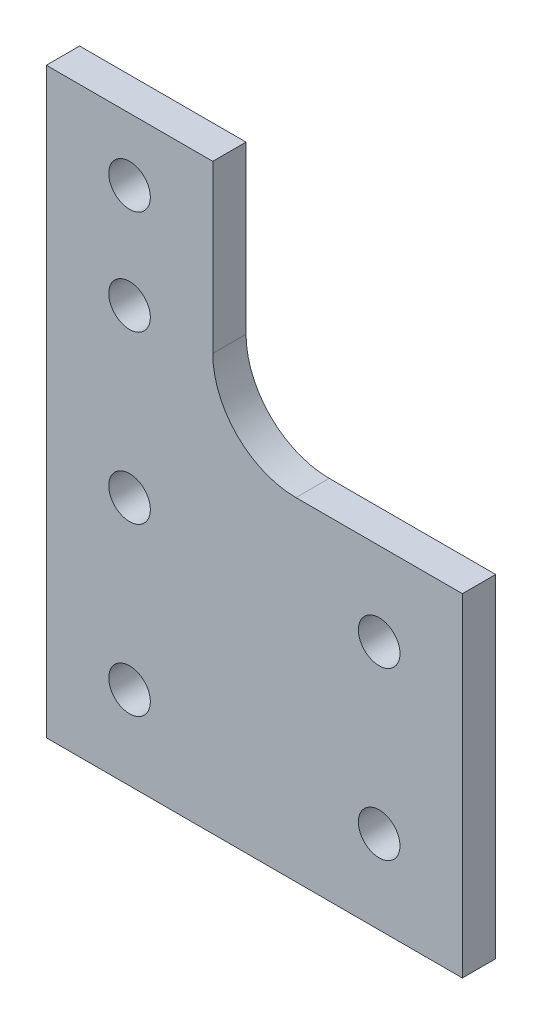
ISO-10303-21;
HEADER;
FILE_DESCRIPTION(('STEP AP214'),'2;1');
FILE_NAME('part.step','',(''),(''),'','','');
FILE_SCHEMA(('AUTOMOTIVE_DESIGN { 1 0 10303 214 1 1 1 1 }'));
ENDSEC;
DATA;
#1=APPLICATION_CONTEXT('core data for automotive mechanical design processes');
#2=APPLICATION_PROTOCOL_DEFINITION('international standard','automotive_design',2000,#1);
#3=PRODUCT_CONTEXT('',#1,'mechanical');
#4=PRODUCT('Part','Part','',(#3));
#5=PRODUCT_RELATED_PRODUCT_CATEGORY('part','',(#4));
#6=PRODUCT_DEFINITION_FORMATION('','',#4);
#7=PRODUCT_DEFINITION_CONTEXT('part definition',#1,'design');
#8=PRODUCT_DEFINITION('design','',#6,#7);
#9=PRODUCT_DEFINITION_SHAPE('','',#8);
#10=(LENGTH_UNIT() NAMED_UNIT(*) SI_UNIT(.MILLI.,.METRE.));
#11=(NAMED_UNIT(*) PLANE_ANGLE_UNIT() SI_UNIT($,.RADIAN.));
#12=(NAMED_UNIT(*) SI_UNIT($,.STERADIAN.) SOLID_ANGLE_UNIT());
#13=UNCERTAINTY_MEASURE_WITH_UNIT(LENGTH_MEASURE(1.E-05),#10,'distance_accuracy_value','');
#14=(GEOMETRIC_REPRESENTATION_CONTEXT(3) GLOBAL_UNCERTAINTY_ASSIGNED_CONTEXT((#13)) GLOBAL_UNIT_ASSIGNED_CONTEXT((#10,
#11,#12)) REPRESENTATION_CONTEXT('',''));
#15=CARTESIAN_POINT('',(0.,0.,0.));
#16=DIRECTION('',(0.,0.,1.));
#17=DIRECTION('',(1.,0.,0.));
#18=AXIS2_PLACEMENT_3D('',#15,#16,#17);
#19=CARTESIAN_POINT('',(9.99999999999999,20.,4.));
#20=DIRECTION('',(0.,0.,-1.));
#21=DIRECTION('',(-1.,0.,0.));
#22=AXIS2_PLACEMENT_3D('',#19,#20,#21);
#23=PLANE('',#22);
#24=CARTESIAN_POINT('',(9.99999999999999,20.,4.));
#25=DIRECTION('',(0.,0.,-1.));
#26=DIRECTION('',(-1.,0.,0.));
#27=AXIS2_PLACEMENT_3D('',#24,#25,#26);
#28=CIRCLE('',#27,10.);
#29=CARTESIAN_POINT('',(10.0000000000001,9.99999999999995,4.));
#30=VERTEX_POINT('',#29);
#31=CARTESIAN_POINT('',(0.,20.,4.));
#32=VERTEX_POINT('',#31);
#33=EDGE_CURVE('E138',#30,#32,#28,.T.);
#34=ORIENTED_EDGE('',*,*,#33,.T.);
#35=DIRECTION('',(0.,1.,0.));
#36=VECTOR('',#35,1.);
#37=CARTESIAN_POINT('',(0.,40.,4.));
#38=LINE('',#37,#36);
#39=CARTESIAN_POINT('',(0.,40.,4.));
#40=VERTEX_POINT('',#39);
#41=EDGE_CURVE('E91',#32,#40,#38,.T.);
#42=ORIENTED_EDGE('',*,*,#41,.T.);
#43=DIRECTION('',(-1.,0.,0.));
#44=VECTOR('',#43,1.);
#45=CARTESIAN_POINT('',(-19.9999999999999,40.,4.));
#46=LINE('',#45,#44);
#47=CARTESIAN_POINT('',(-19.9999999999999,40.,4.));
#48=VERTEX_POINT('',#47);
#49=EDGE_CURVE('E150',#40,#48,#46,.T.);
#50=ORIENTED_EDGE('',*,*,#49,.T.);
#51=DIRECTION('',(0.,-1.,0.));
#52=VECTOR('',#51,1.);
#53=CARTESIAN_POINT('',(-19.9999999999999,-30.,4.));
#54=LINE('',#53,#52);
#55=CARTESIAN_POINT('',(-19.9999999999999,-30.,4.));
#56=VERTEX_POINT('',#55);
#57=EDGE_CURVE('E107',#48,#56,#54,.T.);
#58=ORIENTED_EDGE('',*,*,#57,.T.);
#59=DIRECTION('',(1.,0.,0.));
#60=VECTOR('',#59,1.);
#61=CARTESIAN_POINT('',(-19.9999999999999,-30.,4.));
#62=LINE('',#61,#60);
#63=CARTESIAN_POINT('',(30.,-30.,4.));
#64=VERTEX_POINT('',#63);
#65=EDGE_CURVE('E101',#56,#64,#62,.T.);
#66=ORIENTED_EDGE('',*,*,#65,.T.);
#67=DIRECTION('',(0.,1.,0.));
#68=VECTOR('',#67,1.);
#69=CARTESIAN_POINT('',(30.,-30.,4.));
#70=LINE('',#69,#68);
#71=CARTESIAN_POINT('',(30.,9.99999999999995,4.));
#72=VERTEX_POINT('',#71);
#73=EDGE_CURVE('E105',#64,#72,#70,.T.);
#74=ORIENTED_EDGE('',*,*,#73,.T.);
#75=DIRECTION('',(-1.,0.,0.));
#76=VECTOR('',#75,1.);
#77=CARTESIAN_POINT('',(30.,9.99999999999995,4.));
#78=LINE('',#77,#76);
#79=EDGE_CURVE('E51',#72,#30,#78,.T.);
#80=ORIENTED_EDGE('',*,*,#79,.T.);
#81=EDGE_LOOP('',(#34,#42,#50,#58,#66,#74,#80));
#82=FACE_BOUND('',#81,.T.);
#83=CARTESIAN_POINT('',(-9.99999999999949,32.5,4.));
#84=DIRECTION('',(0.,0.,1.));
#85=DIRECTION('',(1.,0.,0.));
#86=AXIS2_PLACEMENT_3D('',#83,#84,#85);
#87=CIRCLE('',#86,2.49999999999992);
#88=CARTESIAN_POINT('',(-7.49999999999957,32.5,4.));
#89=VERTEX_POINT('',#88);
#90=EDGE_CURVE('E129',#89,#89,#87,.T.);
#91=ORIENTED_EDGE('',*,*,#90,.F.);
#92=EDGE_LOOP('',(#91));
#93=FACE_BOUND('',#92,.T.);
#94=CARTESIAN_POINT('',(-9.99999999999997,0.,4.));
#95=DIRECTION('',(0.,0.,1.));
#96=DIRECTION('',(1.,0.,0.));
#97=AXIS2_PLACEMENT_3D('',#94,#95,#96);
#98=CIRCLE('',#97,2.49999999999992);
#99=CARTESIAN_POINT('',(-7.50000000000005,0.,4.));
#100=VERTEX_POINT('',#99);
#101=EDGE_CURVE('E165',#100,#100,#98,.T.);
#102=ORIENTED_EDGE('',*,*,#101,.F.);
#103=EDGE_LOOP('',(#102));
#104=FACE_BOUND('',#103,.T.);
#105=CARTESIAN_POINT('',(-9.99999999999997,-20.,4.));
#106=DIRECTION('',(0.,0.,1.));
#107=DIRECTION('',(1.,0.,0.));
#108=AXIS2_PLACEMENT_3D('',#105,#106,#107);
#109=CIRCLE('',#108,2.49999999999992);
#110=CARTESIAN_POINT('',(-7.50000000000005,-20.,4.));
#111=VERTEX_POINT('',#110);
#112=EDGE_CURVE('E171',#111,#111,#109,.T.);
#113=ORIENTED_EDGE('',*,*,#112,.F.);
#114=EDGE_LOOP('',(#113));
#115=FACE_BOUND('',#114,.T.);
#116=CARTESIAN_POINT('',(20.,0.,4.));
#117=DIRECTION('',(0.,0.,1.));
#118=DIRECTION('',(1.,0.,0.));
#119=AXIS2_PLACEMENT_3D('',#116,#117,#118);
#120=CIRCLE('',#119,2.49999999999992);
#121=CARTESIAN_POINT('',(22.4999999999999,0.,4.));
#122=VERTEX_POINT('',#121);
#123=EDGE_CURVE('E177',#122,#122,#120,.T.);
#124=ORIENTED_EDGE('',*,*,#123,.F.);
#125=EDGE_LOOP('',(#124));
#126=FACE_BOUND('',#125,.T.);
#127=CARTESIAN_POINT('',(20.,-20.,4.));
#128=DIRECTION('',(0.,0.,1.));
#129=DIRECTION('',(1.,0.,0.));
#130=AXIS2_PLACEMENT_3D('',#127,#128,#129);
#131=CIRCLE('',#130,2.49999999999992);
#132=CARTESIAN_POINT('',(22.4999999999999,-20.,4.));
#133=VERTEX_POINT('',#132);
#134=EDGE_CURVE('E183',#133,#133,#131,.T.);
#135=ORIENTED_EDGE('',*,*,#134,.F.);
#136=EDGE_LOOP('',(#135));
#137=FACE_BOUND('',#136,.T.);
#138=CARTESIAN_POINT('',(-9.9999999999996,20.,4.));
#139=DIRECTION('',(0.,0.,1.));
#140=DIRECTION('',(1.,0.,0.));
#141=AXIS2_PLACEMENT_3D('',#138,#139,#140);
#142=CIRCLE('',#141,2.49999999999992);
#143=CARTESIAN_POINT('',(-7.49999999999968,20.,4.));
#144=VERTEX_POINT('',#143);
#145=EDGE_CURVE('E189',#144,#144,#142,.T.);
#146=ORIENTED_EDGE('',*,*,#145,.F.);
#147=EDGE_LOOP('',(#146));
#148=FACE_BOUND('',#147,.T.);
#149=ADVANCED_FACE('F34',(#82,#93,#104,#115,#126,#137,#148),#23,.F.);
#150=CARTESIAN_POINT('',(9.99999999999999,20.,0.));
#151=DIRECTION('',(0.,0.,-1.));
#152=DIRECTION('',(-1.,0.,0.));
#153=AXIS2_PLACEMENT_3D('',#150,#151,#152);
#154=PLANE('',#153);
#155=CARTESIAN_POINT('',(20.,-20.,0.));
#156=DIRECTION('',(0.,0.,1.));
#157=DIRECTION('',(1.,0.,0.));
#158=AXIS2_PLACEMENT_3D('',#155,#156,#157);
#159=CIRCLE('',#158,2.49999999999992);
#160=CARTESIAN_POINT('',(22.4999999999999,-20.,0.));
#161=VERTEX_POINT('',#160);
#162=EDGE_CURVE('E186',#161,#161,#159,.T.);
#163=ORIENTED_EDGE('',*,*,#162,.T.);
#164=EDGE_LOOP('',(#163));
#165=FACE_BOUND('',#164,.T.);
#166=CARTESIAN_POINT('',(-9.99999999999997,-20.,0.));
#167=DIRECTION('',(0.,0.,1.));
#168=DIRECTION('',(1.,0.,0.));
#169=AXIS2_PLACEMENT_3D('',#166,#167,#168);
#170=CIRCLE('',#169,2.49999999999992);
#171=CARTESIAN_POINT('',(-7.50000000000005,-20.,0.));
#172=VERTEX_POINT('',#171);
#173=EDGE_CURVE('E174',#172,#172,#170,.T.);
#174=ORIENTED_EDGE('',*,*,#173,.T.);
#175=EDGE_LOOP('',(#174));
#176=FACE_BOUND('',#175,.T.);
#177=CARTESIAN_POINT('',(-9.99999999999949,32.5,0.));
#178=DIRECTION('',(0.,0.,1.));
#179=DIRECTION('',(1.,0.,0.));
#180=AXIS2_PLACEMENT_3D('',#177,#178,#179);
#181=CIRCLE('',#180,2.49999999999992);
#182=CARTESIAN_POINT('',(-7.49999999999957,32.5,0.));
#183=VERTEX_POINT('',#182);
#184=EDGE_CURVE('E162',#183,#183,#181,.T.);
#185=ORIENTED_EDGE('',*,*,#184,.T.);
#186=EDGE_LOOP('',(#185));
#187=FACE_BOUND('',#186,.T.);
#188=CARTESIAN_POINT('',(9.99999999999999,20.,0.));
#189=DIRECTION('',(0.,0.,-1.));
#190=DIRECTION('',(-1.,0.,0.));
#191=AXIS2_PLACEMENT_3D('',#188,#189,#190);
#192=CIRCLE('',#191,10.);
#193=CARTESIAN_POINT('',(10.0000000000001,9.99999999999995,0.));
#194=VERTEX_POINT('',#193);
#195=CARTESIAN_POINT('',(0.,20.,0.));
#196=VERTEX_POINT('',#195);
#197=EDGE_CURVE('E125',#194,#196,#192,.T.);
#198=ORIENTED_EDGE('',*,*,#197,.F.);
#199=DIRECTION('',(-1.,0.,0.));
#200=VECTOR('',#199,1.);
#201=CARTESIAN_POINT('',(30.,9.99999999999995,0.));
#202=LINE('',#201,#200);
#203=CARTESIAN_POINT('',(30.,9.99999999999995,0.));
#204=VERTEX_POINT('',#203);
#205=EDGE_CURVE('E83',#204,#194,#202,.T.);
#206=ORIENTED_EDGE('',*,*,#205,.F.);
#207=DIRECTION('',(0.,1.,0.));
#208=VECTOR('',#207,1.);
#209=CARTESIAN_POINT('',(30.,-30.,0.));
#210=LINE('',#209,#208);
#211=CARTESIAN_POINT('',(30.,-30.,0.));
#212=VERTEX_POINT('',#211);
#213=EDGE_CURVE('E77',#212,#204,#210,.T.);
#214=ORIENTED_EDGE('',*,*,#213,.F.);
#215=DIRECTION('',(1.,0.,0.));
#216=VECTOR('',#215,1.);
#217=CARTESIAN_POINT('',(-19.9999999999999,-30.,0.));
#218=LINE('',#217,#216);
#219=CARTESIAN_POINT('',(-19.9999999999999,-30.,0.));
#220=VERTEX_POINT('',#219);
#221=EDGE_CURVE('E115',#220,#212,#218,.T.);
#222=ORIENTED_EDGE('',*,*,#221,.F.);
#223=DIRECTION('',(0.,-1.,0.));
#224=VECTOR('',#223,1.);
#225=CARTESIAN_POINT('',(-19.9999999999999,-30.,0.));
#226=LINE('',#225,#224);
#227=CARTESIAN_POINT('',(-19.9999999999999,40.,0.));
#228=VERTEX_POINT('',#227);
#229=EDGE_CURVE('E133',#228,#220,#226,.T.);
#230=ORIENTED_EDGE('',*,*,#229,.F.);
#231=DIRECTION('',(-1.,0.,0.));
#232=VECTOR('',#231,1.);
#233=CARTESIAN_POINT('',(-19.9999999999999,40.,0.));
#234=LINE('',#233,#232);
#235=CARTESIAN_POINT('',(0.,40.,0.));
#236=VERTEX_POINT('',#235);
#237=EDGE_CURVE('E131',#236,#228,#234,.T.);
#238=ORIENTED_EDGE('',*,*,#237,.F.);
#239=DIRECTION('',(0.,1.,0.));
#240=VECTOR('',#239,1.);
#241=CARTESIAN_POINT('',(0.,40.,0.));
#242=LINE('',#241,#240);
#243=EDGE_CURVE('E128',#196,#236,#242,.T.);
#244=ORIENTED_EDGE('',*,*,#243,.F.);
#245=EDGE_LOOP('',(#198,#206,#214,#222,#230,#238,#244));
#246=FACE_BOUND('',#245,.T.);
#247=CARTESIAN_POINT('',(-9.99999999999997,0.,0.));
#248=DIRECTION('',(0.,0.,1.));
#249=DIRECTION('',(1.,0.,0.));
#250=AXIS2_PLACEMENT_3D('',#247,#248,#249);
#251=CIRCLE('',#250,2.49999999999992);
#252=CARTESIAN_POINT('',(-7.50000000000005,0.,0.));
#253=VERTEX_POINT('',#252);
#254=EDGE_CURVE('E168',#253,#253,#251,.T.);
#255=ORIENTED_EDGE('',*,*,#254,.T.);
#256=EDGE_LOOP('',(#255));
#257=FACE_BOUND('',#256,.T.);
#258=CARTESIAN_POINT('',(20.,0.,0.));
#259=DIRECTION('',(0.,0.,1.));
#260=DIRECTION('',(1.,0.,0.));
#261=AXIS2_PLACEMENT_3D('',#258,#259,#260);
#262=CIRCLE('',#261,2.49999999999992);
#263=CARTESIAN_POINT('',(22.4999999999999,0.,0.));
#264=VERTEX_POINT('',#263);
#265=EDGE_CURVE('E180',#264,#264,#262,.T.);
#266=ORIENTED_EDGE('',*,*,#265,.T.);
#267=EDGE_LOOP('',(#266));
#268=FACE_BOUND('',#267,.T.);
#269=CARTESIAN_POINT('',(-9.9999999999996,20.,0.));
#270=DIRECTION('',(0.,0.,1.));
#271=DIRECTION('',(1.,0.,0.));
#272=AXIS2_PLACEMENT_3D('',#269,#270,#271);
#273=CIRCLE('',#272,2.49999999999992);
#274=CARTESIAN_POINT('',(-7.49999999999968,20.,0.));
#275=VERTEX_POINT('',#274);
#276=EDGE_CURVE('E192',#275,#275,#273,.T.);
#277=ORIENTED_EDGE('',*,*,#276,.T.);
#278=EDGE_LOOP('',(#277));
#279=FACE_BOUND('',#278,.T.);
#280=ADVANCED_FACE('F154',(#165,#176,#187,#246,#257,#268,#279),#154,.T.);
#281=CARTESIAN_POINT('',(9.99999999999999,20.,4.));
#282=DIRECTION('',(0.,0.,-1.));
#283=DIRECTION('',(-1.,0.,0.));
#284=AXIS2_PLACEMENT_3D('',#281,#282,#283);
#285=CYLINDRICAL_SURFACE('',#284,10.);
#286=ORIENTED_EDGE('',*,*,#197,.T.);
#287=DIRECTION('',(0.,0.,-1.));
#288=VECTOR('',#287,1.);
#289=CARTESIAN_POINT('',(0.,20.,4.));
#290=LINE('',#289,#288);
#291=EDGE_CURVE('E11',#32,#196,#290,.T.);
#292=ORIENTED_EDGE('',*,*,#291,.F.);
#293=ORIENTED_EDGE('',*,*,#33,.F.);
#294=DIRECTION('',(0.,0.,-1.));
#295=VECTOR('',#294,1.);
#296=CARTESIAN_POINT('',(10.0000000000001,9.99999999999995,4.));
#297=LINE('',#296,#295);
#298=EDGE_CURVE('E121',#30,#194,#297,.T.);
#299=ORIENTED_EDGE('',*,*,#298,.T.);
#300=EDGE_LOOP('',(#286,#292,#293,#299));
#301=FACE_BOUND('',#300,.T.);
#302=ADVANCED_FACE('F36',(#301),#285,.F.);
#303=CARTESIAN_POINT('',(0.,40.,4.));
#304=DIRECTION('',(-1.,0.,0.));
#305=DIRECTION('',(0.,-1.,0.));
#306=AXIS2_PLACEMENT_3D('',#303,#304,#305);
#307=PLANE('',#306);
#308=ORIENTED_EDGE('',*,*,#243,.T.);
#309=DIRECTION('',(0.,0.,-1.));
#310=VECTOR('',#309,1.);
#311=CARTESIAN_POINT('',(0.,40.,4.));
#312=LINE('',#311,#310);
#313=EDGE_CURVE('E43',#40,#236,#312,.T.);
#314=ORIENTED_EDGE('',*,*,#313,.F.);
#315=ORIENTED_EDGE('',*,*,#41,.F.);
#316=ORIENTED_EDGE('',*,*,#291,.T.);
#317=EDGE_LOOP('',(#308,#314,#315,#316));
#318=FACE_BOUND('',#317,.T.);
#319=ADVANCED_FACE('F222',(#318),#307,.F.);
#320=CARTESIAN_POINT('',(-19.9999999999999,40.,4.));
#321=DIRECTION('',(0.,-1.,0.));
#322=DIRECTION('',(0.,0.,-1.));
#323=AXIS2_PLACEMENT_3D('',#320,#321,#322);
#324=PLANE('',#323);
#325=ORIENTED_EDGE('',*,*,#237,.T.);
#326=DIRECTION('',(0.,0.,-1.));
#327=VECTOR('',#326,1.);
#328=CARTESIAN_POINT('',(-19.9999999999999,40.,4.));
#329=LINE('',#328,#327);
#330=EDGE_CURVE('E142',#48,#228,#329,.T.);
#331=ORIENTED_EDGE('',*,*,#330,.F.);
#332=ORIENTED_EDGE('',*,*,#49,.F.);
#333=ORIENTED_EDGE('',*,*,#313,.T.);
#334=EDGE_LOOP('',(#325,#331,#332,#333));
#335=FACE_BOUND('',#334,.T.);
#336=ADVANCED_FACE('F148',(#335),#324,.F.);
#337=CARTESIAN_POINT('',(-19.9999999999999,-30.,4.));
#338=DIRECTION('',(1.,0.,0.));
#339=DIRECTION('',(0.,0.,-1.));
#340=AXIS2_PLACEMENT_3D('',#337,#338,#339);
#341=PLANE('',#340);
#342=ORIENTED_EDGE('',*,*,#229,.T.);
#343=DIRECTION('',(0.,0.,-1.));
#344=VECTOR('',#343,1.);
#345=CARTESIAN_POINT('',(-19.9999999999999,-30.,4.));
#346=LINE('',#345,#344);
#347=EDGE_CURVE('E116',#56,#220,#346,.T.);
#348=ORIENTED_EDGE('',*,*,#347,.F.);
#349=ORIENTED_EDGE('',*,*,#57,.F.);
#350=ORIENTED_EDGE('',*,*,#330,.T.);
#351=EDGE_LOOP('',(#342,#348,#349,#350));
#352=FACE_BOUND('',#351,.T.);
#353=ADVANCED_FACE('F157',(#352),#341,.F.);
#354=CARTESIAN_POINT('',(-19.9999999999999,-30.,4.));
#355=DIRECTION('',(0.,1.,0.));
#356=DIRECTION('',(0.,0.,1.));
#357=AXIS2_PLACEMENT_3D('',#354,#355,#356);
#358=PLANE('',#357);
#359=ORIENTED_EDGE('',*,*,#221,.T.);
#360=DIRECTION('',(0.,0.,-1.));
#361=VECTOR('',#360,1.);
#362=CARTESIAN_POINT('',(30.,-30.,4.));
#363=LINE('',#362,#361);
#364=EDGE_CURVE('E112',#64,#212,#363,.T.);
#365=ORIENTED_EDGE('',*,*,#364,.F.);
#366=ORIENTED_EDGE('',*,*,#65,.F.);
#367=ORIENTED_EDGE('',*,*,#347,.T.);
#368=EDGE_LOOP('',(#359,#365,#366,#367));
#369=FACE_BOUND('',#368,.T.);
#370=ADVANCED_FACE('F113',(#369),#358,.F.);
#371=CARTESIAN_POINT('',(30.,-30.,4.));
#372=DIRECTION('',(-1.,0.,0.));
#373=DIRECTION('',(0.,0.,1.));
#374=AXIS2_PLACEMENT_3D('',#371,#372,#373);
#375=PLANE('',#374);
#376=ORIENTED_EDGE('',*,*,#213,.T.);
#377=DIRECTION('',(0.,0.,-1.));
#378=VECTOR('',#377,1.);
#379=CARTESIAN_POINT('',(30.,9.99999999999995,4.));
#380=LINE('',#379,#378);
#381=EDGE_CURVE('E117',#72,#204,#380,.T.);
#382=ORIENTED_EDGE('',*,*,#381,.F.);
#383=ORIENTED_EDGE('',*,*,#73,.F.);
#384=ORIENTED_EDGE('',*,*,#364,.T.);
#385=EDGE_LOOP('',(#376,#382,#383,#384));
#386=FACE_BOUND('',#385,.T.);
#387=ADVANCED_FACE('F119',(#386),#375,.F.);
#388=CARTESIAN_POINT('',(30.,9.99999999999995,4.));
#389=DIRECTION('',(0.,-1.,0.));
#390=DIRECTION('',(0.,0.,-1.));
#391=AXIS2_PLACEMENT_3D('',#388,#389,#390);
#392=PLANE('',#391);
#393=ORIENTED_EDGE('',*,*,#205,.T.);
#394=ORIENTED_EDGE('',*,*,#298,.F.);
#395=ORIENTED_EDGE('',*,*,#79,.F.);
#396=ORIENTED_EDGE('',*,*,#381,.T.);
#397=EDGE_LOOP('',(#393,#394,#395,#396));
#398=FACE_BOUND('',#397,.T.);
#399=ADVANCED_FACE('F212',(#398),#392,.F.);
#400=CARTESIAN_POINT('',(-9.99999999999949,32.5,4.));
#401=DIRECTION('',(0.,0.,-1.));
#402=DIRECTION('',(-1.,0.,0.));
#403=AXIS2_PLACEMENT_3D('',#400,#401,#402);
#404=CYLINDRICAL_SURFACE('',#403,2.49999999999992);
#405=ORIENTED_EDGE('',*,*,#90,.T.);
#406=EDGE_LOOP('',(#405));
#407=FACE_BOUND('',#406,.T.);
#408=ORIENTED_EDGE('',*,*,#184,.F.);
#409=EDGE_LOOP('',(#408));
#410=FACE_BOUND('',#409,.T.);
#411=ADVANCED_FACE('F209',(#407,#410),#404,.F.);
#412=CARTESIAN_POINT('',(-9.99999999999997,0.,4.));
#413=DIRECTION('',(0.,0.,-1.));
#414=DIRECTION('',(-1.,0.,0.));
#415=AXIS2_PLACEMENT_3D('',#412,#413,#414);
#416=CYLINDRICAL_SURFACE('',#415,2.49999999999992);
#417=ORIENTED_EDGE('',*,*,#101,.T.);
#418=EDGE_LOOP('',(#417));
#419=FACE_BOUND('',#418,.T.);
#420=ORIENTED_EDGE('',*,*,#254,.F.);
#421=EDGE_LOOP('',(#420));
#422=FACE_BOUND('',#421,.T.);
#423=ADVANCED_FACE('F281',(#419,#422),#416,.F.);
#424=CARTESIAN_POINT('',(-9.99999999999997,-20.,4.));
#425=DIRECTION('',(0.,0.,-1.));
#426=DIRECTION('',(-1.,0.,0.));
#427=AXIS2_PLACEMENT_3D('',#424,#425,#426);
#428=CYLINDRICAL_SURFACE('',#427,2.49999999999992);
#429=ORIENTED_EDGE('',*,*,#112,.T.);
#430=EDGE_LOOP('',(#429));
#431=FACE_BOUND('',#430,.T.);
#432=ORIENTED_EDGE('',*,*,#173,.F.);
#433=EDGE_LOOP('',(#432));
#434=FACE_BOUND('',#433,.T.);
#435=ADVANCED_FACE('F289',(#431,#434),#428,.F.);
#436=CARTESIAN_POINT('',(20.,0.,4.));
#437=DIRECTION('',(0.,0.,-1.));
#438=DIRECTION('',(-1.,0.,0.));
#439=AXIS2_PLACEMENT_3D('',#436,#437,#438);
#440=CYLINDRICAL_SURFACE('',#439,2.49999999999992);
#441=ORIENTED_EDGE('',*,*,#123,.T.);
#442=EDGE_LOOP('',(#441));
#443=FACE_BOUND('',#442,.T.);
#444=ORIENTED_EDGE('',*,*,#265,.F.);
#445=EDGE_LOOP('',(#444));
#446=FACE_BOUND('',#445,.T.);
#447=ADVANCED_FACE('F297',(#443,#446),#440,.F.);
#448=CARTESIAN_POINT('',(20.,-20.,4.));
#449=DIRECTION('',(0.,0.,-1.));
#450=DIRECTION('',(-1.,0.,0.));
#451=AXIS2_PLACEMENT_3D('',#448,#449,#450);
#452=CYLINDRICAL_SURFACE('',#451,2.49999999999992);
#453=ORIENTED_EDGE('',*,*,#134,.T.);
#454=EDGE_LOOP('',(#453));
#455=FACE_BOUND('',#454,.T.);
#456=ORIENTED_EDGE('',*,*,#162,.F.);
#457=EDGE_LOOP('',(#456));
#458=FACE_BOUND('',#457,.T.);
#459=ADVANCED_FACE('F306',(#455,#458),#452,.F.);
#460=CARTESIAN_POINT('',(-9.9999999999996,20.,4.));
#461=DIRECTION('',(0.,0.,-1.));
#462=DIRECTION('',(-1.,0.,0.));
#463=AXIS2_PLACEMENT_3D('',#460,#461,#462);
#464=CYLINDRICAL_SURFACE('',#463,2.49999999999992);
#465=ORIENTED_EDGE('',*,*,#145,.T.);
#466=EDGE_LOOP('',(#465));
#467=FACE_BOUND('',#466,.T.);
#468=ORIENTED_EDGE('',*,*,#276,.F.);
#469=EDGE_LOOP('',(#468));
#470=FACE_BOUND('',#469,.T.);
#471=ADVANCED_FACE('F198',(#467,#470),#464,.F.);
#472=CLOSED_SHELL('',(#149,#280,#302,#319,#336,#353,#370,#387,#399,#411,#423,#435,#447,#459,#471));
#473=MANIFOLD_SOLID_BREP('B2',#472);
#474=ADVANCED_BREP_SHAPE_REPRESENTATION('',(#18,#473),#14);
#475=SHAPE_DEFINITION_REPRESENTATION(#9,#474);
ENDSEC;
END-ISO-10303-21;
